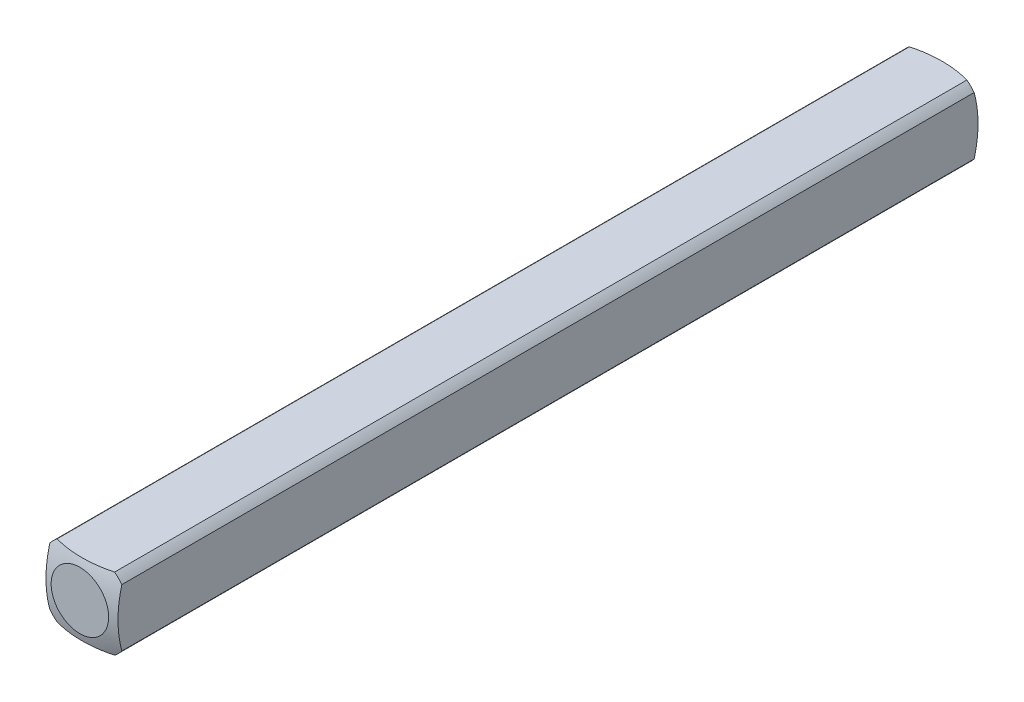
ISO-10303-21;
HEADER;
FILE_DESCRIPTION(('STEP AP214'),'2;1');
FILE_NAME('part.step','',(''),(''),'','','');
FILE_SCHEMA(('AUTOMOTIVE_DESIGN { 1 0 10303 214 1 1 1 1 }'));
ENDSEC;
DATA;
#1=APPLICATION_CONTEXT('core data for automotive mechanical design processes');
#2=APPLICATION_PROTOCOL_DEFINITION('international standard','automotive_design',2000,#1);
#3=PRODUCT_CONTEXT('',#1,'mechanical');
#4=PRODUCT('Part','Part','',(#3));
#5=PRODUCT_RELATED_PRODUCT_CATEGORY('part','',(#4));
#6=PRODUCT_DEFINITION_FORMATION('','',#4);
#7=PRODUCT_DEFINITION_CONTEXT('part definition',#1,'design');
#8=PRODUCT_DEFINITION('design','',#6,#7);
#9=PRODUCT_DEFINITION_SHAPE('','',#8);
#10=(LENGTH_UNIT() NAMED_UNIT(*) SI_UNIT(.MILLI.,.METRE.));
#11=(NAMED_UNIT(*) PLANE_ANGLE_UNIT() SI_UNIT($,.RADIAN.));
#12=(NAMED_UNIT(*) SI_UNIT($,.STERADIAN.) SOLID_ANGLE_UNIT());
#13=UNCERTAINTY_MEASURE_WITH_UNIT(LENGTH_MEASURE(1.E-05),#10,'distance_accuracy_value','');
#14=(GEOMETRIC_REPRESENTATION_CONTEXT(3) GLOBAL_UNCERTAINTY_ASSIGNED_CONTEXT((#13)) GLOBAL_UNIT_ASSIGNED_CONTEXT((#10,
#11,#12)) REPRESENTATION_CONTEXT('',''));
#15=CARTESIAN_POINT('',(0.,0.,0.));
#16=DIRECTION('',(0.,0.,1.));
#17=DIRECTION('',(1.,0.,0.));
#18=AXIS2_PLACEMENT_3D('',#15,#16,#17);
#19=CARTESIAN_POINT('',(-1.5875,-1.5875,19.05));
#20=DIRECTION('',(1.,0.,0.));
#21=DIRECTION('',(0.,0.,-1.));
#22=AXIS2_PLACEMENT_3D('',#19,#20,#21);
#23=PLANE('',#22);
#24=CARTESIAN_POINT('',(-1.5875,0.,4.91912226376204));
#25=DIRECTION('',(1.,0.,0.));
#26=DIRECTION('',(0.,0.,-1.));
#27=AXIS2_PLACEMENT_3D('',#24,#25,#26);
#28=CIRCLE('',#27,4.82558221875869);
#29=CARTESIAN_POINT('',(-1.5875,-1.26841150657032,0.263225357686905));
#30=VERTEX_POINT('',#29);
#31=CARTESIAN_POINT('',(-1.5875,1.26841150657032,0.263225357686917));
#32=VERTEX_POINT('',#31);
#33=EDGE_CURVE('E55',#30,#32,#28,.T.);
#34=ORIENTED_EDGE('',*,*,#33,.F.);
#35=DIRECTION('',(0.,0.,-1.));
#36=VECTOR('',#35,1.);
#37=CARTESIAN_POINT('',(-1.5875,-1.26841150657032,19.05));
#38=LINE('',#37,#36);
#39=CARTESIAN_POINT('',(-1.5875,-1.26841150657032,37.8367746423131));
#40=VERTEX_POINT('',#39);
#41=EDGE_CURVE('E48',#40,#30,#38,.T.);
#42=ORIENTED_EDGE('',*,*,#41,.F.);
#43=CARTESIAN_POINT('',(-1.5875,0.,33.180877736238));
#44=DIRECTION('',(-1.,0.,0.));
#45=DIRECTION('',(0.,0.,1.));
#46=AXIS2_PLACEMENT_3D('',#43,#44,#45);
#47=CIRCLE('',#46,4.82558221875869);
#48=CARTESIAN_POINT('',(-1.5875,1.26841150657032,37.8367746423131));
#49=VERTEX_POINT('',#48);
#50=EDGE_CURVE('E134',#40,#49,#47,.T.);
#51=ORIENTED_EDGE('',*,*,#50,.T.);
#52=DIRECTION('',(0.,0.,-1.));
#53=VECTOR('',#52,1.);
#54=CARTESIAN_POINT('',(-1.5875,1.26841150657032,19.05));
#55=LINE('',#54,#53);
#56=EDGE_CURVE('E120',#32,#49,#55,.F.);
#57=ORIENTED_EDGE('',*,*,#56,.F.);
#58=EDGE_LOOP('',(#34,#42,#51,#57));
#59=FACE_BOUND('',#58,.T.);
#60=ADVANCED_FACE('F40',(#59),#23,.F.);
#61=CARTESIAN_POINT('',(-1.5875,-1.5875,19.05));
#62=DIRECTION('',(0.,1.,0.));
#63=DIRECTION('',(0.,0.,1.));
#64=AXIS2_PLACEMENT_3D('',#61,#62,#63);
#65=PLANE('',#64);
#66=CARTESIAN_POINT('',(0.,-1.5875,4.91912226376204));
#67=DIRECTION('',(0.,1.,0.));
#68=DIRECTION('',(0.,0.,1.));
#69=AXIS2_PLACEMENT_3D('',#66,#67,#68);
#70=CIRCLE('',#69,4.82558221875869);
#71=CARTESIAN_POINT('',(1.26841150657032,-1.5875,0.263225357686905));
#72=VERTEX_POINT('',#71);
#73=CARTESIAN_POINT('',(-1.26841150657032,-1.5875,0.263225357686908));
#74=VERTEX_POINT('',#73);
#75=EDGE_CURVE('E175',#72,#74,#70,.T.);
#76=ORIENTED_EDGE('',*,*,#75,.F.);
#77=DIRECTION('',(0.,0.,-1.));
#78=VECTOR('',#77,1.);
#79=CARTESIAN_POINT('',(1.26841150657032,-1.5875,19.05));
#80=LINE('',#79,#78);
#81=CARTESIAN_POINT('',(1.26841150657032,-1.5875,37.8367746423131));
#82=VERTEX_POINT('',#81);
#83=EDGE_CURVE('E195',#82,#72,#80,.T.);
#84=ORIENTED_EDGE('',*,*,#83,.F.);
#85=CARTESIAN_POINT('',(0.,-1.5875,33.180877736238));
#86=DIRECTION('',(0.,-1.,0.));
#87=DIRECTION('',(0.,0.,-1.));
#88=AXIS2_PLACEMENT_3D('',#85,#86,#87);
#89=CIRCLE('',#88,4.82558221875869);
#90=CARTESIAN_POINT('',(-1.26841150657032,-1.5875,37.8367746423131));
#91=VERTEX_POINT('',#90);
#92=EDGE_CURVE('E149',#82,#91,#89,.T.);
#93=ORIENTED_EDGE('',*,*,#92,.T.);
#94=DIRECTION('',(0.,0.,-1.));
#95=VECTOR('',#94,1.);
#96=CARTESIAN_POINT('',(-1.26841150657032,-1.5875,19.05));
#97=LINE('',#96,#95);
#98=EDGE_CURVE('E192',#74,#91,#97,.F.);
#99=ORIENTED_EDGE('',*,*,#98,.F.);
#100=EDGE_LOOP('',(#76,#84,#93,#99));
#101=FACE_BOUND('',#100,.T.);
#102=ADVANCED_FACE('F208',(#101),#65,.F.);
#103=CARTESIAN_POINT('',(1.5875,-1.5875,19.05));
#104=DIRECTION('',(-1.,0.,0.));
#105=DIRECTION('',(0.,0.,1.));
#106=AXIS2_PLACEMENT_3D('',#103,#104,#105);
#107=PLANE('',#106);
#108=CARTESIAN_POINT('',(1.5875,0.,4.91912226376204));
#109=DIRECTION('',(-1.,0.,0.));
#110=DIRECTION('',(0.,0.,1.));
#111=AXIS2_PLACEMENT_3D('',#108,#109,#110);
#112=CIRCLE('',#111,4.82558221875869);
#113=CARTESIAN_POINT('',(1.5875,1.26841150657032,0.263225357686908));
#114=VERTEX_POINT('',#113);
#115=CARTESIAN_POINT('',(1.5875,-1.26841150657032,0.263225357686905));
#116=VERTEX_POINT('',#115);
#117=EDGE_CURVE('E172',#114,#116,#112,.T.);
#118=ORIENTED_EDGE('',*,*,#117,.F.);
#119=DIRECTION('',(0.,0.,-1.));
#120=VECTOR('',#119,1.);
#121=CARTESIAN_POINT('',(1.5875,1.26841150657032,19.05));
#122=LINE('',#121,#120);
#123=CARTESIAN_POINT('',(1.5875,1.26841150657032,37.8367746423131));
#124=VERTEX_POINT('',#123);
#125=EDGE_CURVE('E188',#124,#114,#122,.T.);
#126=ORIENTED_EDGE('',*,*,#125,.F.);
#127=CARTESIAN_POINT('',(1.5875,0.,33.180877736238));
#128=DIRECTION('',(1.,0.,0.));
#129=DIRECTION('',(0.,0.,-1.));
#130=AXIS2_PLACEMENT_3D('',#127,#128,#129);
#131=CIRCLE('',#130,4.82558221875869);
#132=CARTESIAN_POINT('',(1.5875,-1.26841150657032,37.8367746423131));
#133=VERTEX_POINT('',#132);
#134=EDGE_CURVE('E145',#124,#133,#131,.T.);
#135=ORIENTED_EDGE('',*,*,#134,.T.);
#136=DIRECTION('',(0.,0.,-1.));
#137=VECTOR('',#136,1.);
#138=CARTESIAN_POINT('',(1.5875,-1.26841150657032,19.05));
#139=LINE('',#138,#137);
#140=EDGE_CURVE('E113',#116,#133,#139,.F.);
#141=ORIENTED_EDGE('',*,*,#140,.F.);
#142=EDGE_LOOP('',(#118,#126,#135,#141));
#143=FACE_BOUND('',#142,.T.);
#144=ADVANCED_FACE('F215',(#143),#107,.F.);
#145=CARTESIAN_POINT('',(-1.5875,1.5875,19.05));
#146=DIRECTION('',(0.,-1.,0.));
#147=DIRECTION('',(0.,0.,-1.));
#148=AXIS2_PLACEMENT_3D('',#145,#146,#147);
#149=PLANE('',#148);
#150=CARTESIAN_POINT('',(0.,1.5875,4.91912226376204));
#151=DIRECTION('',(0.,-1.,0.));
#152=DIRECTION('',(0.,0.,-1.));
#153=AXIS2_PLACEMENT_3D('',#150,#151,#152);
#154=CIRCLE('',#153,4.82558221875869);
#155=CARTESIAN_POINT('',(-1.26841150657032,1.5875,0.263225357686908));
#156=VERTEX_POINT('',#155);
#157=CARTESIAN_POINT('',(1.26841150657032,1.5875,0.263225357686905));
#158=VERTEX_POINT('',#157);
#159=EDGE_CURVE('E110',#156,#158,#154,.T.);
#160=ORIENTED_EDGE('',*,*,#159,.F.);
#161=DIRECTION('',(0.,0.,-1.));
#162=VECTOR('',#161,1.);
#163=CARTESIAN_POINT('',(-1.26841150657032,1.5875,19.05));
#164=LINE('',#163,#162);
#165=CARTESIAN_POINT('',(-1.26841150657032,1.5875,37.8367746423131));
#166=VERTEX_POINT('',#165);
#167=EDGE_CURVE('E104',#166,#156,#164,.T.);
#168=ORIENTED_EDGE('',*,*,#167,.F.);
#169=CARTESIAN_POINT('',(0.,1.5875,33.180877736238));
#170=DIRECTION('',(0.,1.,0.));
#171=DIRECTION('',(0.,0.,1.));
#172=AXIS2_PLACEMENT_3D('',#169,#170,#171);
#173=CIRCLE('',#172,4.82558221875869);
#174=CARTESIAN_POINT('',(1.26841150657032,1.5875,37.8367746423131));
#175=VERTEX_POINT('',#174);
#176=EDGE_CURVE('E109',#166,#175,#173,.T.);
#177=ORIENTED_EDGE('',*,*,#176,.T.);
#178=DIRECTION('',(0.,0.,-1.));
#179=VECTOR('',#178,1.);
#180=CARTESIAN_POINT('',(1.26841150657032,1.5875,19.05));
#181=LINE('',#180,#179);
#182=EDGE_CURVE('E114',#158,#175,#181,.F.);
#183=ORIENTED_EDGE('',*,*,#182,.F.);
#184=EDGE_LOOP('',(#160,#168,#177,#183));
#185=FACE_BOUND('',#184,.T.);
#186=ADVANCED_FACE('F106',(#185),#149,.F.);
#187=CARTESIAN_POINT('',(0.,0.,19.05));
#188=DIRECTION('',(0.,0.,-1.));
#189=DIRECTION('',(-1.,0.,0.));
#190=AXIS2_PLACEMENT_3D('',#187,#188,#189);
#191=CYLINDRICAL_SURFACE('',#190,2.032);
#192=ORIENTED_EDGE('',*,*,#41,.T.);
#193=CARTESIAN_POINT('',(0.,0.,0.263225357686908));
#194=DIRECTION('',(0.,0.,1.));
#195=DIRECTION('',(1.,0.,0.));
#196=AXIS2_PLACEMENT_3D('',#193,#194,#195);
#197=CIRCLE('',#196,2.032);
#198=EDGE_CURVE('E168',#30,#74,#197,.T.);
#199=ORIENTED_EDGE('',*,*,#198,.T.);
#200=ORIENTED_EDGE('',*,*,#98,.T.);
#201=CARTESIAN_POINT('',(0.,0.,37.8367746423131));
#202=DIRECTION('',(0.,0.,1.));
#203=DIRECTION('',(1.,0.,0.));
#204=AXIS2_PLACEMENT_3D('',#201,#202,#203);
#205=CIRCLE('',#204,2.032);
#206=EDGE_CURVE('E141',#40,#91,#205,.T.);
#207=ORIENTED_EDGE('',*,*,#206,.F.);
#208=EDGE_LOOP('',(#192,#199,#200,#207));
#209=FACE_BOUND('',#208,.T.);
#210=ADVANCED_FACE('F204',(#209),#191,.T.);
#211=ORIENTED_EDGE('',*,*,#83,.T.);
#212=CARTESIAN_POINT('',(0.,0.,0.263225357686908));
#213=DIRECTION('',(0.,0.,1.));
#214=DIRECTION('',(1.,0.,0.));
#215=AXIS2_PLACEMENT_3D('',#212,#213,#214);
#216=CIRCLE('',#215,2.032);
#217=EDGE_CURVE('E61',#72,#116,#216,.T.);
#218=ORIENTED_EDGE('',*,*,#217,.T.);
#219=ORIENTED_EDGE('',*,*,#140,.T.);
#220=CARTESIAN_POINT('',(0.,0.,37.8367746423131));
#221=DIRECTION('',(0.,0.,1.));
#222=DIRECTION('',(1.,0.,0.));
#223=AXIS2_PLACEMENT_3D('',#220,#221,#222);
#224=CIRCLE('',#223,2.032);
#225=EDGE_CURVE('E153',#82,#133,#224,.T.);
#226=ORIENTED_EDGE('',*,*,#225,.F.);
#227=EDGE_LOOP('',(#211,#218,#219,#226));
#228=FACE_BOUND('',#227,.T.);
#229=ADVANCED_FACE('F211',(#228),#191,.T.);
#230=ORIENTED_EDGE('',*,*,#125,.T.);
#231=CARTESIAN_POINT('',(0.,0.,0.263225357686908));
#232=DIRECTION('',(0.,0.,1.));
#233=DIRECTION('',(1.,0.,0.));
#234=AXIS2_PLACEMENT_3D('',#231,#232,#233);
#235=CIRCLE('',#234,2.032);
#236=EDGE_CURVE('E164',#114,#158,#235,.T.);
#237=ORIENTED_EDGE('',*,*,#236,.T.);
#238=ORIENTED_EDGE('',*,*,#182,.T.);
#239=CARTESIAN_POINT('',(0.,0.,37.8367746423131));
#240=DIRECTION('',(0.,0.,1.));
#241=DIRECTION('',(1.,0.,0.));
#242=AXIS2_PLACEMENT_3D('',#239,#240,#241);
#243=CIRCLE('',#242,2.032);
#244=EDGE_CURVE('E132',#124,#175,#243,.T.);
#245=ORIENTED_EDGE('',*,*,#244,.F.);
#246=EDGE_LOOP('',(#230,#237,#238,#245));
#247=FACE_BOUND('',#246,.T.);
#248=ADVANCED_FACE('F217',(#247),#191,.T.);
#249=ORIENTED_EDGE('',*,*,#167,.T.);
#250=CARTESIAN_POINT('',(0.,0.,0.263225357686908));
#251=DIRECTION('',(0.,0.,1.));
#252=DIRECTION('',(1.,0.,0.));
#253=AXIS2_PLACEMENT_3D('',#250,#251,#252);
#254=CIRCLE('',#253,2.032);
#255=EDGE_CURVE('E12',#156,#32,#254,.T.);
#256=ORIENTED_EDGE('',*,*,#255,.T.);
#257=ORIENTED_EDGE('',*,*,#56,.T.);
#258=CARTESIAN_POINT('',(0.,0.,37.8367746423131));
#259=DIRECTION('',(0.,0.,1.));
#260=DIRECTION('',(1.,0.,0.));
#261=AXIS2_PLACEMENT_3D('',#258,#259,#260);
#262=CIRCLE('',#261,2.032);
#263=EDGE_CURVE('E117',#166,#49,#262,.T.);
#264=ORIENTED_EDGE('',*,*,#263,.F.);
#265=EDGE_LOOP('',(#249,#256,#257,#264));
#266=FACE_BOUND('',#265,.T.);
#267=ADVANCED_FACE('F118',(#266),#191,.T.);
#268=CARTESIAN_POINT('',(0.,0.,4.91912226376204));
#269=DIRECTION('',(0.,0.,1.));
#270=DIRECTION('',(-1.,0.,0.));
#271=AXIS2_PLACEMENT_3D('',#268,#269,#270);
#272=SPHERICAL_SURFACE('',#271,5.08);
#273=CARTESIAN_POINT('',(0.,0.,0.));
#274=DIRECTION('',(0.,0.,-1.));
#275=DIRECTION('',(-1.,0.,0.));
#276=AXIS2_PLACEMENT_3D('',#273,#274,#275);
#277=CIRCLE('',#276,1.26832020963187);
#278=CARTESIAN_POINT('',(-1.26832020963187,0.,0.));
#279=VERTEX_POINT('',#278);
#280=EDGE_CURVE('E180',#279,#279,#277,.T.);
#281=ORIENTED_EDGE('',*,*,#280,.F.);
#282=EDGE_LOOP('',(#281));
#283=FACE_BOUND('',#282,.T.);
#284=ORIENTED_EDGE('',*,*,#75,.T.);
#285=ORIENTED_EDGE('',*,*,#198,.F.);
#286=ORIENTED_EDGE('',*,*,#33,.T.);
#287=ORIENTED_EDGE('',*,*,#255,.F.);
#288=ORIENTED_EDGE('',*,*,#159,.T.);
#289=ORIENTED_EDGE('',*,*,#236,.F.);
#290=ORIENTED_EDGE('',*,*,#117,.T.);
#291=ORIENTED_EDGE('',*,*,#217,.F.);
#292=EDGE_LOOP('',(#284,#285,#286,#287,#288,#289,#290,#291));
#293=FACE_BOUND('',#292,.T.);
#294=ADVANCED_FACE('F218',(#283,#293),#272,.T.);
#295=CARTESIAN_POINT('',(0.,0.,0.));
#296=DIRECTION('',(0.,0.,-1.));
#297=DIRECTION('',(-1.,0.,0.));
#298=AXIS2_PLACEMENT_3D('',#295,#296,#297);
#299=PLANE('',#298);
#300=ORIENTED_EDGE('',*,*,#280,.T.);
#301=EDGE_LOOP('',(#300));
#302=FACE_BOUND('',#301,.T.);
#303=ADVANCED_FACE('F220',(#302),#299,.T.);
#304=CARTESIAN_POINT('',(0.,0.,33.180877736238));
#305=DIRECTION('',(0.,0.,-1.));
#306=DIRECTION('',(-1.,0.,0.));
#307=AXIS2_PLACEMENT_3D('',#304,#305,#306);
#308=SPHERICAL_SURFACE('',#307,5.08);
#309=CARTESIAN_POINT('',(0.,0.,38.1));
#310=DIRECTION('',(0.,0.,-1.));
#311=DIRECTION('',(-1.,0.,0.));
#312=AXIS2_PLACEMENT_3D('',#309,#310,#311);
#313=CIRCLE('',#312,1.26832020963187);
#314=CARTESIAN_POINT('',(-1.26832020963187,0.,38.1));
#315=VERTEX_POINT('',#314);
#316=EDGE_CURVE('E125',#315,#315,#313,.T.);
#317=ORIENTED_EDGE('',*,*,#316,.T.);
#318=EDGE_LOOP('',(#317));
#319=FACE_BOUND('',#318,.T.);
#320=ORIENTED_EDGE('',*,*,#92,.F.);
#321=ORIENTED_EDGE('',*,*,#225,.T.);
#322=ORIENTED_EDGE('',*,*,#134,.F.);
#323=ORIENTED_EDGE('',*,*,#244,.T.);
#324=ORIENTED_EDGE('',*,*,#176,.F.);
#325=ORIENTED_EDGE('',*,*,#263,.T.);
#326=ORIENTED_EDGE('',*,*,#50,.F.);
#327=ORIENTED_EDGE('',*,*,#206,.T.);
#328=EDGE_LOOP('',(#320,#321,#322,#323,#324,#325,#326,#327));
#329=FACE_BOUND('',#328,.T.);
#330=ADVANCED_FACE('F129',(#319,#329),#308,.T.);
#331=CARTESIAN_POINT('',(0.,0.,38.1));
#332=DIRECTION('',(0.,0.,1.));
#333=DIRECTION('',(-1.,0.,0.));
#334=AXIS2_PLACEMENT_3D('',#331,#332,#333);
#335=PLANE('',#334);
#336=ORIENTED_EDGE('',*,*,#316,.F.);
#337=EDGE_LOOP('',(#336));
#338=FACE_BOUND('',#337,.T.);
#339=ADVANCED_FACE('F265',(#338),#335,.T.);
#340=CLOSED_SHELL('',(#60,#102,#144,#186,#210,#229,#248,#267,#294,#303,#330,#339));
#341=MANIFOLD_SOLID_BREP('B2',#340);
#342=ADVANCED_BREP_SHAPE_REPRESENTATION('',(#18,#341),#14);
#343=SHAPE_DEFINITION_REPRESENTATION(#9,#342);
ENDSEC;
END-ISO-10303-21;
